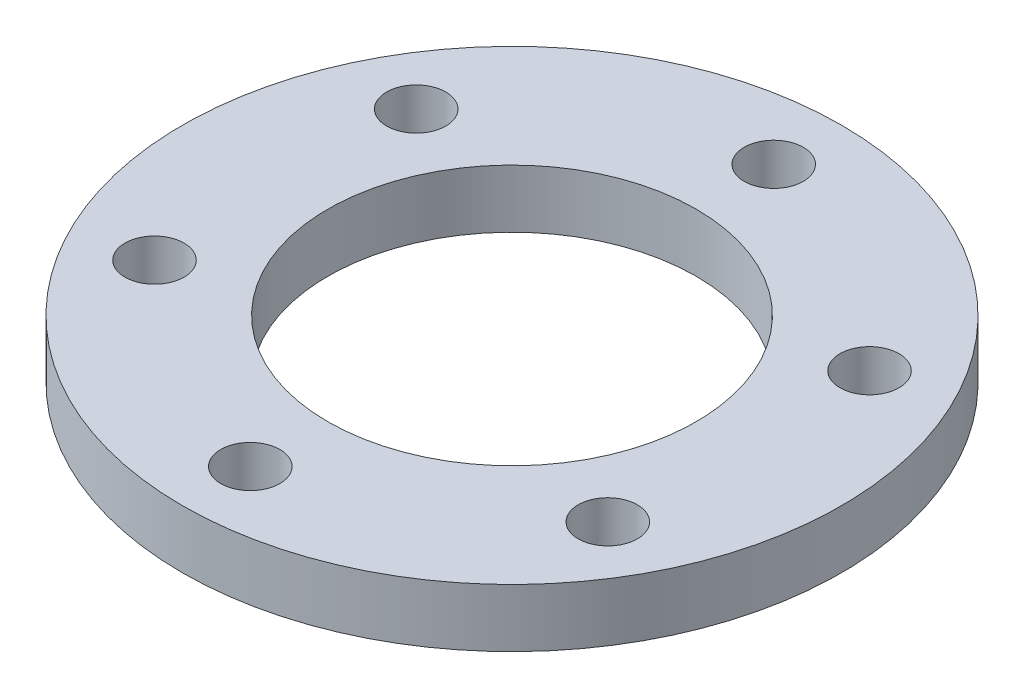
ISO-10303-21;
HEADER;
FILE_DESCRIPTION(('STEP AP214'),'2;1');
FILE_NAME('part.step','',(''),(''),'','','');
FILE_SCHEMA(('AUTOMOTIVE_DESIGN { 1 0 10303 214 1 1 1 1 }'));
ENDSEC;
DATA;
#1=APPLICATION_CONTEXT('core data for automotive mechanical design processes');
#2=APPLICATION_PROTOCOL_DEFINITION('international standard','automotive_design',2000,#1);
#3=PRODUCT_CONTEXT('',#1,'mechanical');
#4=PRODUCT('Part','Part','',(#3));
#5=PRODUCT_RELATED_PRODUCT_CATEGORY('part','',(#4));
#6=PRODUCT_DEFINITION_FORMATION('','',#4);
#7=PRODUCT_DEFINITION_CONTEXT('part definition',#1,'design');
#8=PRODUCT_DEFINITION('design','',#6,#7);
#9=PRODUCT_DEFINITION_SHAPE('','',#8);
#10=(LENGTH_UNIT() NAMED_UNIT(*) SI_UNIT(.MILLI.,.METRE.));
#11=(NAMED_UNIT(*) PLANE_ANGLE_UNIT() SI_UNIT($,.RADIAN.));
#12=(NAMED_UNIT(*) SI_UNIT($,.STERADIAN.) SOLID_ANGLE_UNIT());
#13=UNCERTAINTY_MEASURE_WITH_UNIT(LENGTH_MEASURE(1.E-05),#10,'distance_accuracy_value','');
#14=(GEOMETRIC_REPRESENTATION_CONTEXT(3) GLOBAL_UNCERTAINTY_ASSIGNED_CONTEXT((#13)) GLOBAL_UNIT_ASSIGNED_CONTEXT((#10,
#11,#12)) REPRESENTATION_CONTEXT('',''));
#15=CARTESIAN_POINT('',(0.,0.,0.));
#16=DIRECTION('',(0.,0.,1.));
#17=DIRECTION('',(1.,0.,0.));
#18=AXIS2_PLACEMENT_3D('',#15,#16,#17);
#19=CARTESIAN_POINT('',(0.,3.,0.));
#20=DIRECTION('',(0.,1.,0.));
#21=DIRECTION('',(0.,0.,1.));
#22=AXIS2_PLACEMENT_3D('',#19,#20,#21);
#23=PLANE('',#22);
#24=CARTESIAN_POINT('',(0.,3.,-13.5));
#25=DIRECTION('',(0.,1.,0.));
#26=DIRECTION('',(0.,0.,1.));
#27=AXIS2_PLACEMENT_3D('',#24,#25,#26);
#28=CIRCLE('',#27,1.525);
#29=CARTESIAN_POINT('',(0.,3.,-11.975));
#30=VERTEX_POINT('',#29);
#31=EDGE_CURVE('E67',#30,#30,#28,.T.);
#32=ORIENTED_EDGE('',*,*,#31,.F.);
#33=EDGE_LOOP('',(#32));
#34=FACE_BOUND('',#33,.T.);
#35=CARTESIAN_POINT('',(-11.6913429510899,3.,-6.74999999999999));
#36=DIRECTION('',(0.,1.,0.));
#37=DIRECTION('',(0.,0.,1.));
#38=AXIS2_PLACEMENT_3D('',#35,#36,#37);
#39=CIRCLE('',#38,1.525);
#40=CARTESIAN_POINT('',(-11.6913429510899,3.,-5.22499999999999));
#41=VERTEX_POINT('',#40);
#42=EDGE_CURVE('E101',#41,#41,#39,.T.);
#43=ORIENTED_EDGE('',*,*,#42,.F.);
#44=EDGE_LOOP('',(#43));
#45=FACE_BOUND('',#44,.T.);
#46=CARTESIAN_POINT('',(-11.6913429510899,3.,6.75000000000001));
#47=DIRECTION('',(0.,1.,0.));
#48=DIRECTION('',(0.,0.,1.));
#49=AXIS2_PLACEMENT_3D('',#46,#47,#48);
#50=CIRCLE('',#49,1.525);
#51=CARTESIAN_POINT('',(-11.6913429510899,3.,8.27500000000001));
#52=VERTEX_POINT('',#51);
#53=EDGE_CURVE('E96',#52,#52,#50,.T.);
#54=ORIENTED_EDGE('',*,*,#53,.F.);
#55=EDGE_LOOP('',(#54));
#56=FACE_BOUND('',#55,.T.);
#57=CARTESIAN_POINT('',(0.,3.,13.5));
#58=DIRECTION('',(0.,1.,0.));
#59=DIRECTION('',(0.,0.,1.));
#60=AXIS2_PLACEMENT_3D('',#57,#58,#59);
#61=CIRCLE('',#60,1.525);
#62=CARTESIAN_POINT('',(0.,3.,15.025));
#63=VERTEX_POINT('',#62);
#64=EDGE_CURVE('E100',#63,#63,#61,.T.);
#65=ORIENTED_EDGE('',*,*,#64,.F.);
#66=EDGE_LOOP('',(#65));
#67=FACE_BOUND('',#66,.T.);
#68=CARTESIAN_POINT('',(11.6913429510899,3.,6.75));
#69=DIRECTION('',(0.,1.,0.));
#70=DIRECTION('',(0.,0.,1.));
#71=AXIS2_PLACEMENT_3D('',#68,#69,#70);
#72=CIRCLE('',#71,1.525);
#73=CARTESIAN_POINT('',(11.6913429510899,3.,8.275));
#74=VERTEX_POINT('',#73);
#75=EDGE_CURVE('E105',#74,#74,#72,.T.);
#76=ORIENTED_EDGE('',*,*,#75,.F.);
#77=EDGE_LOOP('',(#76));
#78=FACE_BOUND('',#77,.T.);
#79=CARTESIAN_POINT('',(11.6913429510899,3.,-6.75));
#80=DIRECTION('',(0.,1.,0.));
#81=DIRECTION('',(0.,0.,1.));
#82=AXIS2_PLACEMENT_3D('',#79,#80,#81);
#83=CIRCLE('',#82,1.525);
#84=CARTESIAN_POINT('',(11.6913429510899,3.,-5.225));
#85=VERTEX_POINT('',#84);
#86=EDGE_CURVE('E109',#85,#85,#83,.T.);
#87=ORIENTED_EDGE('',*,*,#86,.F.);
#88=EDGE_LOOP('',(#87));
#89=FACE_BOUND('',#88,.T.);
#90=CARTESIAN_POINT('',(0.,3.,0.));
#91=DIRECTION('',(0.,1.,0.));
#92=DIRECTION('',(0.,0.,1.));
#93=AXIS2_PLACEMENT_3D('',#90,#91,#92);
#94=CIRCLE('',#93,17.);
#95=CARTESIAN_POINT('',(0.,3.,17.));
#96=VERTEX_POINT('',#95);
#97=EDGE_CURVE('E10',#96,#96,#94,.T.);
#98=ORIENTED_EDGE('',*,*,#97,.T.);
#99=EDGE_LOOP('',(#98));
#100=FACE_BOUND('',#99,.T.);
#101=CARTESIAN_POINT('',(0.,3.,0.));
#102=DIRECTION('',(0.,1.,0.));
#103=DIRECTION('',(0.,0.,1.));
#104=AXIS2_PLACEMENT_3D('',#101,#102,#103);
#105=CIRCLE('',#104,9.5);
#106=CARTESIAN_POINT('',(0.,3.,9.5));
#107=VERTEX_POINT('',#106);
#108=EDGE_CURVE('E56',#107,#107,#105,.T.);
#109=ORIENTED_EDGE('',*,*,#108,.F.);
#110=EDGE_LOOP('',(#109));
#111=FACE_BOUND('',#110,.T.);
#112=ADVANCED_FACE('F41',(#34,#45,#56,#67,#78,#89,#100,#111),#23,.T.);
#113=CARTESIAN_POINT('',(0.,0.,0.));
#114=DIRECTION('',(0.,1.,0.));
#115=DIRECTION('',(0.,0.,1.));
#116=AXIS2_PLACEMENT_3D('',#113,#114,#115);
#117=PLANE('',#116);
#118=CARTESIAN_POINT('',(0.,0.,-13.5));
#119=DIRECTION('',(0.,1.,0.));
#120=DIRECTION('',(0.,0.,1.));
#121=AXIS2_PLACEMENT_3D('',#118,#119,#120);
#122=CIRCLE('',#121,1.525);
#123=CARTESIAN_POINT('',(0.,0.,-11.975));
#124=VERTEX_POINT('',#123);
#125=EDGE_CURVE('E45',#124,#124,#122,.T.);
#126=ORIENTED_EDGE('',*,*,#125,.T.);
#127=EDGE_LOOP('',(#126));
#128=FACE_BOUND('',#127,.T.);
#129=CARTESIAN_POINT('',(-11.6913429510899,0.,-6.74999999999999));
#130=DIRECTION('',(0.,1.,0.));
#131=DIRECTION('',(0.,0.,1.));
#132=AXIS2_PLACEMENT_3D('',#129,#130,#131);
#133=CIRCLE('',#132,1.525);
#134=CARTESIAN_POINT('',(-11.6913429510899,0.,-5.22499999999999));
#135=VERTEX_POINT('',#134);
#136=EDGE_CURVE('E78',#135,#135,#133,.T.);
#137=ORIENTED_EDGE('',*,*,#136,.T.);
#138=EDGE_LOOP('',(#137));
#139=FACE_BOUND('',#138,.T.);
#140=CARTESIAN_POINT('',(-11.6913429510899,0.,6.75000000000001));
#141=DIRECTION('',(0.,1.,0.));
#142=DIRECTION('',(0.,0.,1.));
#143=AXIS2_PLACEMENT_3D('',#140,#141,#142);
#144=CIRCLE('',#143,1.525);
#145=CARTESIAN_POINT('',(-11.6913429510899,0.,8.27500000000001));
#146=VERTEX_POINT('',#145);
#147=EDGE_CURVE('E75',#146,#146,#144,.T.);
#148=ORIENTED_EDGE('',*,*,#147,.T.);
#149=EDGE_LOOP('',(#148));
#150=FACE_BOUND('',#149,.T.);
#151=CARTESIAN_POINT('',(0.,0.,13.5));
#152=DIRECTION('',(0.,1.,0.));
#153=DIRECTION('',(0.,0.,1.));
#154=AXIS2_PLACEMENT_3D('',#151,#152,#153);
#155=CIRCLE('',#154,1.525);
#156=CARTESIAN_POINT('',(0.,0.,15.025));
#157=VERTEX_POINT('',#156);
#158=EDGE_CURVE('E71',#157,#157,#155,.T.);
#159=ORIENTED_EDGE('',*,*,#158,.T.);
#160=EDGE_LOOP('',(#159));
#161=FACE_BOUND('',#160,.T.);
#162=CARTESIAN_POINT('',(11.6913429510899,0.,6.75));
#163=DIRECTION('',(0.,1.,0.));
#164=DIRECTION('',(0.,0.,1.));
#165=AXIS2_PLACEMENT_3D('',#162,#163,#164);
#166=CIRCLE('',#165,1.525);
#167=CARTESIAN_POINT('',(11.6913429510899,0.,8.275));
#168=VERTEX_POINT('',#167);
#169=EDGE_CURVE('E66',#168,#168,#166,.T.);
#170=ORIENTED_EDGE('',*,*,#169,.T.);
#171=EDGE_LOOP('',(#170));
#172=FACE_BOUND('',#171,.T.);
#173=CARTESIAN_POINT('',(11.6913429510899,0.,-6.75));
#174=DIRECTION('',(0.,1.,0.));
#175=DIRECTION('',(0.,0.,1.));
#176=AXIS2_PLACEMENT_3D('',#173,#174,#175);
#177=CIRCLE('',#176,1.525);
#178=CARTESIAN_POINT('',(11.6913429510899,0.,-5.225));
#179=VERTEX_POINT('',#178);
#180=EDGE_CURVE('E62',#179,#179,#177,.T.);
#181=ORIENTED_EDGE('',*,*,#180,.T.);
#182=EDGE_LOOP('',(#181));
#183=FACE_BOUND('',#182,.T.);
#184=CARTESIAN_POINT('',(0.,0.,0.));
#185=DIRECTION('',(0.,1.,0.));
#186=DIRECTION('',(0.,0.,1.));
#187=AXIS2_PLACEMENT_3D('',#184,#185,#186);
#188=CIRCLE('',#187,17.);
#189=CARTESIAN_POINT('',(0.,0.,17.));
#190=VERTEX_POINT('',#189);
#191=EDGE_CURVE('E50',#190,#190,#188,.T.);
#192=ORIENTED_EDGE('',*,*,#191,.F.);
#193=EDGE_LOOP('',(#192));
#194=FACE_BOUND('',#193,.T.);
#195=CARTESIAN_POINT('',(0.,0.,0.));
#196=DIRECTION('',(0.,1.,0.));
#197=DIRECTION('',(0.,0.,1.));
#198=AXIS2_PLACEMENT_3D('',#195,#196,#197);
#199=CIRCLE('',#198,9.5);
#200=CARTESIAN_POINT('',(0.,0.,9.5));
#201=VERTEX_POINT('',#200);
#202=EDGE_CURVE('E59',#201,#201,#199,.T.);
#203=ORIENTED_EDGE('',*,*,#202,.T.);
#204=EDGE_LOOP('',(#203));
#205=FACE_BOUND('',#204,.T.);
#206=ADVANCED_FACE('F125',(#128,#139,#150,#161,#172,#183,#194,#205),#117,.F.);
#207=CARTESIAN_POINT('',(0.,3.,0.));
#208=DIRECTION('',(0.,-1.,0.));
#209=DIRECTION('',(0.,0.,-1.));
#210=AXIS2_PLACEMENT_3D('',#207,#208,#209);
#211=CYLINDRICAL_SURFACE('',#210,17.);
#212=ORIENTED_EDGE('',*,*,#97,.F.);
#213=EDGE_LOOP('',(#212));
#214=FACE_BOUND('',#213,.T.);
#215=ORIENTED_EDGE('',*,*,#191,.T.);
#216=EDGE_LOOP('',(#215));
#217=FACE_BOUND('',#216,.T.);
#218=ADVANCED_FACE('F43',(#214,#217),#211,.T.);
#219=CARTESIAN_POINT('',(0.,3.,0.));
#220=DIRECTION('',(0.,-1.,0.));
#221=DIRECTION('',(0.,0.,-1.));
#222=AXIS2_PLACEMENT_3D('',#219,#220,#221);
#223=CYLINDRICAL_SURFACE('',#222,9.5);
#224=ORIENTED_EDGE('',*,*,#108,.T.);
#225=EDGE_LOOP('',(#224));
#226=FACE_BOUND('',#225,.T.);
#227=ORIENTED_EDGE('',*,*,#202,.F.);
#228=EDGE_LOOP('',(#227));
#229=FACE_BOUND('',#228,.T.);
#230=ADVANCED_FACE('F142',(#226,#229),#223,.F.);
#231=CARTESIAN_POINT('',(11.6913429510899,-97.,-6.75));
#232=DIRECTION('',(0.,1.,0.));
#233=DIRECTION('',(0.,0.,1.));
#234=AXIS2_PLACEMENT_3D('',#231,#232,#233);
#235=CYLINDRICAL_SURFACE('',#234,1.525);
#236=ORIENTED_EDGE('',*,*,#86,.T.);
#237=EDGE_LOOP('',(#236));
#238=FACE_BOUND('',#237,.T.);
#239=ORIENTED_EDGE('',*,*,#180,.F.);
#240=EDGE_LOOP('',(#239));
#241=FACE_BOUND('',#240,.T.);
#242=ADVANCED_FACE('F138',(#238,#241),#235,.F.);
#243=CARTESIAN_POINT('',(11.6913429510899,-97.,6.75));
#244=DIRECTION('',(0.,1.,0.));
#245=DIRECTION('',(0.,0.,1.));
#246=AXIS2_PLACEMENT_3D('',#243,#244,#245);
#247=CYLINDRICAL_SURFACE('',#246,1.525);
#248=ORIENTED_EDGE('',*,*,#75,.T.);
#249=EDGE_LOOP('',(#248));
#250=FACE_BOUND('',#249,.T.);
#251=ORIENTED_EDGE('',*,*,#169,.F.);
#252=EDGE_LOOP('',(#251));
#253=FACE_BOUND('',#252,.T.);
#254=ADVANCED_FACE('F141',(#250,#253),#247,.F.);
#255=CARTESIAN_POINT('',(0.,-97.,13.5));
#256=DIRECTION('',(0.,1.,0.));
#257=DIRECTION('',(0.,0.,1.));
#258=AXIS2_PLACEMENT_3D('',#255,#256,#257);
#259=CYLINDRICAL_SURFACE('',#258,1.525);
#260=ORIENTED_EDGE('',*,*,#64,.T.);
#261=EDGE_LOOP('',(#260));
#262=FACE_BOUND('',#261,.T.);
#263=ORIENTED_EDGE('',*,*,#158,.F.);
#264=EDGE_LOOP('',(#263));
#265=FACE_BOUND('',#264,.T.);
#266=ADVANCED_FACE('F164',(#262,#265),#259,.F.);
#267=CARTESIAN_POINT('',(-11.6913429510899,-97.,6.75000000000001));
#268=DIRECTION('',(0.,1.,0.));
#269=DIRECTION('',(0.,0.,1.));
#270=AXIS2_PLACEMENT_3D('',#267,#268,#269);
#271=CYLINDRICAL_SURFACE('',#270,1.525);
#272=ORIENTED_EDGE('',*,*,#53,.T.);
#273=EDGE_LOOP('',(#272));
#274=FACE_BOUND('',#273,.T.);
#275=ORIENTED_EDGE('',*,*,#147,.F.);
#276=EDGE_LOOP('',(#275));
#277=FACE_BOUND('',#276,.T.);
#278=ADVANCED_FACE('F160',(#274,#277),#271,.F.);
#279=CARTESIAN_POINT('',(-11.6913429510899,-97.,-6.74999999999999));
#280=DIRECTION('',(0.,1.,0.));
#281=DIRECTION('',(0.,0.,1.));
#282=AXIS2_PLACEMENT_3D('',#279,#280,#281);
#283=CYLINDRICAL_SURFACE('',#282,1.525);
#284=ORIENTED_EDGE('',*,*,#42,.T.);
#285=EDGE_LOOP('',(#284));
#286=FACE_BOUND('',#285,.T.);
#287=ORIENTED_EDGE('',*,*,#136,.F.);
#288=EDGE_LOOP('',(#287));
#289=FACE_BOUND('',#288,.T.);
#290=ADVANCED_FACE('F163',(#286,#289),#283,.F.);
#291=CARTESIAN_POINT('',(0.,-97.,-13.5));
#292=DIRECTION('',(0.,1.,0.));
#293=DIRECTION('',(0.,0.,1.));
#294=AXIS2_PLACEMENT_3D('',#291,#292,#293);
#295=CYLINDRICAL_SURFACE('',#294,1.525);
#296=ORIENTED_EDGE('',*,*,#31,.T.);
#297=EDGE_LOOP('',(#296));
#298=FACE_BOUND('',#297,.T.);
#299=ORIENTED_EDGE('',*,*,#125,.F.);
#300=EDGE_LOOP('',(#299));
#301=FACE_BOUND('',#300,.T.);
#302=ADVANCED_FACE('F120',(#298,#301),#295,.F.);
#303=CLOSED_SHELL('',(#112,#206,#218,#230,#242,#254,#266,#278,#290,#302));
#304=MANIFOLD_SOLID_BREP('B2',#303);
#305=ADVANCED_BREP_SHAPE_REPRESENTATION('',(#18,#304),#14);
#306=SHAPE_DEFINITION_REPRESENTATION(#9,#305);
ENDSEC;
END-ISO-10303-21;
